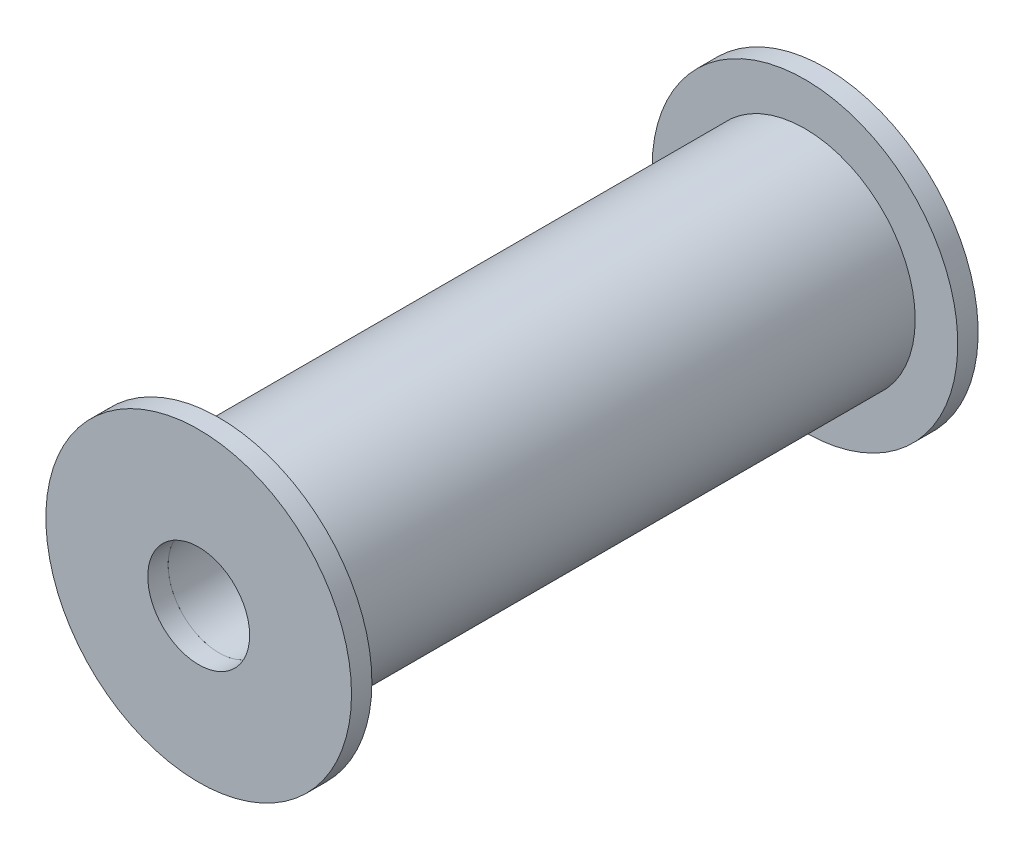
ISO-10303-21;
HEADER;
FILE_DESCRIPTION(('STEP AP214'),'2;1');
FILE_NAME('part.step','',(''),(''),'','','');
FILE_SCHEMA(('AUTOMOTIVE_DESIGN { 1 0 10303 214 1 1 1 1 }'));
ENDSEC;
DATA;
#1=APPLICATION_CONTEXT('core data for automotive mechanical design processes');
#2=APPLICATION_PROTOCOL_DEFINITION('international standard','automotive_design',2000,#1);
#3=PRODUCT_CONTEXT('',#1,'mechanical');
#4=PRODUCT('Part','Part','',(#3));
#5=PRODUCT_RELATED_PRODUCT_CATEGORY('part','',(#4));
#6=PRODUCT_DEFINITION_FORMATION('','',#4);
#7=PRODUCT_DEFINITION_CONTEXT('part definition',#1,'design');
#8=PRODUCT_DEFINITION('design','',#6,#7);
#9=PRODUCT_DEFINITION_SHAPE('','',#8);
#10=(LENGTH_UNIT() NAMED_UNIT(*) SI_UNIT(.MILLI.,.METRE.));
#11=(NAMED_UNIT(*) PLANE_ANGLE_UNIT() SI_UNIT($,.RADIAN.));
#12=(NAMED_UNIT(*) SI_UNIT($,.STERADIAN.) SOLID_ANGLE_UNIT());
#13=UNCERTAINTY_MEASURE_WITH_UNIT(LENGTH_MEASURE(1.E-05),#10,'distance_accuracy_value','');
#14=(GEOMETRIC_REPRESENTATION_CONTEXT(3) GLOBAL_UNCERTAINTY_ASSIGNED_CONTEXT((#13)) GLOBAL_UNIT_ASSIGNED_CONTEXT((#10,
#11,#12)) REPRESENTATION_CONTEXT('',''));
#15=CARTESIAN_POINT('',(0.,0.,0.));
#16=DIRECTION('',(0.,0.,1.));
#17=DIRECTION('',(1.,0.,0.));
#18=AXIS2_PLACEMENT_3D('',#15,#16,#17);
#19=CARTESIAN_POINT('',(0.,0.,119.));
#20=DIRECTION('',(0.,0.,1.));
#21=DIRECTION('',(1.,0.,0.));
#22=AXIS2_PLACEMENT_3D('',#19,#20,#21);
#23=PLANE('',#22);
#24=CARTESIAN_POINT('',(0.,0.,119.));
#25=DIRECTION('',(0.,0.,1.));
#26=DIRECTION('',(1.,0.,0.));
#27=AXIS2_PLACEMENT_3D('',#24,#25,#26);
#28=CIRCLE('',#27,30.);
#29=CARTESIAN_POINT('',(30.,0.,119.));
#30=VERTEX_POINT('',#29);
#31=EDGE_CURVE('E11',#30,#30,#28,.T.);
#32=ORIENTED_EDGE('',*,*,#31,.T.);
#33=EDGE_LOOP('',(#32));
#34=FACE_BOUND('',#33,.T.);
#35=CARTESIAN_POINT('',(0.,0.,119.));
#36=DIRECTION('',(0.,0.,1.));
#37=DIRECTION('',(1.,0.,0.));
#38=AXIS2_PLACEMENT_3D('',#35,#36,#37);
#39=CIRCLE('',#38,10.);
#40=CARTESIAN_POINT('',(10.,0.,119.));
#41=VERTEX_POINT('',#40);
#42=EDGE_CURVE('E56',#41,#41,#39,.T.);
#43=ORIENTED_EDGE('',*,*,#42,.F.);
#44=EDGE_LOOP('',(#43));
#45=FACE_BOUND('',#44,.T.);
#46=ADVANCED_FACE('F45',(#34,#45),#23,.T.);
#47=CARTESIAN_POINT('',(0.,0.,115.));
#48=DIRECTION('',(0.,0.,1.));
#49=DIRECTION('',(1.,0.,0.));
#50=AXIS2_PLACEMENT_3D('',#47,#48,#49);
#51=PLANE('',#50);
#52=CARTESIAN_POINT('',(0.,0.,115.));
#53=DIRECTION('',(0.,0.,1.));
#54=DIRECTION('',(1.,0.,0.));
#55=AXIS2_PLACEMENT_3D('',#52,#53,#54);
#56=CIRCLE('',#55,30.);
#57=CARTESIAN_POINT('',(30.,0.,115.));
#58=VERTEX_POINT('',#57);
#59=EDGE_CURVE('E49',#58,#58,#56,.T.);
#60=ORIENTED_EDGE('',*,*,#59,.F.);
#61=EDGE_LOOP('',(#60));
#62=FACE_BOUND('',#61,.T.);
#63=CARTESIAN_POINT('',(0.,0.,115.));
#64=DIRECTION('',(0.,0.,1.));
#65=DIRECTION('',(1.,0.,0.));
#66=AXIS2_PLACEMENT_3D('',#63,#64,#65);
#67=CIRCLE('',#66,10.);
#68=CARTESIAN_POINT('',(10.,0.,115.));
#69=VERTEX_POINT('',#68);
#70=EDGE_CURVE('E58',#69,#69,#67,.T.);
#71=ORIENTED_EDGE('',*,*,#70,.T.);
#72=EDGE_LOOP('',(#71));
#73=FACE_BOUND('',#72,.T.);
#74=ADVANCED_FACE('F68',(#62,#73),#51,.F.);
#75=CARTESIAN_POINT('',(0.,0.,119.));
#76=DIRECTION('',(0.,0.,-1.));
#77=DIRECTION('',(-1.,0.,0.));
#78=AXIS2_PLACEMENT_3D('',#75,#76,#77);
#79=CYLINDRICAL_SURFACE('',#78,30.);
#80=ORIENTED_EDGE('',*,*,#31,.F.);
#81=EDGE_LOOP('',(#80));
#82=FACE_BOUND('',#81,.T.);
#83=ORIENTED_EDGE('',*,*,#59,.T.);
#84=EDGE_LOOP('',(#83));
#85=FACE_BOUND('',#84,.T.);
#86=ADVANCED_FACE('F47',(#82,#85),#79,.T.);
#87=CARTESIAN_POINT('',(0.,0.,119.));
#88=DIRECTION('',(0.,0.,-1.));
#89=DIRECTION('',(-1.,0.,0.));
#90=AXIS2_PLACEMENT_3D('',#87,#88,#89);
#91=CYLINDRICAL_SURFACE('',#90,10.);
#92=ORIENTED_EDGE('',*,*,#42,.T.);
#93=EDGE_LOOP('',(#92));
#94=FACE_BOUND('',#93,.T.);
#95=ORIENTED_EDGE('',*,*,#70,.F.);
#96=EDGE_LOOP('',(#95));
#97=FACE_BOUND('',#96,.T.);
#98=ADVANCED_FACE('F64',(#94,#97),#91,.F.);
#99=CLOSED_SHELL('',(#46,#74,#86,#98));
#100=MANIFOLD_SOLID_BREP('B2',#99);
#101=CARTESIAN_POINT('',(0.,0.,115.));
#102=DIRECTION('',(0.,0.,1.));
#103=DIRECTION('',(1.,0.,0.));
#104=AXIS2_PLACEMENT_3D('',#101,#102,#103);
#105=PLANE('',#104);
#106=CARTESIAN_POINT('',(0.,0.,115.));
#107=DIRECTION('',(0.,0.,1.));
#108=DIRECTION('',(1.,0.,0.));
#109=AXIS2_PLACEMENT_3D('',#106,#107,#108);
#110=CIRCLE('',#109,21.643869335);
#111=CARTESIAN_POINT('',(21.643869335,0.,115.));
#112=VERTEX_POINT('',#111);
#113=EDGE_CURVE('E44',#112,#112,#110,.T.);
#114=ORIENTED_EDGE('',*,*,#113,.T.);
#115=EDGE_LOOP('',(#114));
#116=FACE_BOUND('',#115,.T.);
#117=CARTESIAN_POINT('',(0.,0.,115.));
#118=DIRECTION('',(0.,0.,1.));
#119=DIRECTION('',(1.,0.,0.));
#120=AXIS2_PLACEMENT_3D('',#117,#118,#119);
#121=CIRCLE('',#120,10.);
#122=CARTESIAN_POINT('',(10.,0.,115.));
#123=VERTEX_POINT('',#122);
#124=EDGE_CURVE('E115',#123,#123,#121,.T.);
#125=ORIENTED_EDGE('',*,*,#124,.F.);
#126=EDGE_LOOP('',(#125));
#127=FACE_BOUND('',#126,.T.);
#128=ADVANCED_FACE('F107',(#116,#127),#105,.T.);
#129=CARTESIAN_POINT('',(0.,0.,115.));
#130=DIRECTION('',(0.,0.,-1.));
#131=DIRECTION('',(-1.,0.,0.));
#132=AXIS2_PLACEMENT_3D('',#129,#130,#131);
#133=CYLINDRICAL_SURFACE('',#132,21.643869335);
#134=ORIENTED_EDGE('',*,*,#113,.F.);
#135=EDGE_LOOP('',(#134));
#136=FACE_BOUND('',#135,.T.);
#137=CARTESIAN_POINT('',(0.,0.,0.));
#138=DIRECTION('',(0.,0.,1.));
#139=DIRECTION('',(1.,0.,0.));
#140=AXIS2_PLACEMENT_3D('',#137,#138,#139);
#141=CIRCLE('',#140,21.643869335);
#142=CARTESIAN_POINT('',(21.643869335,0.,0.));
#143=VERTEX_POINT('',#142);
#144=EDGE_CURVE('E111',#143,#143,#141,.T.);
#145=ORIENTED_EDGE('',*,*,#144,.T.);
#146=EDGE_LOOP('',(#145));
#147=FACE_BOUND('',#146,.T.);
#148=ADVANCED_FACE('F109',(#136,#147),#133,.T.);
#149=CARTESIAN_POINT('',(0.,0.,115.));
#150=DIRECTION('',(0.,0.,-1.));
#151=DIRECTION('',(-1.,0.,0.));
#152=AXIS2_PLACEMENT_3D('',#149,#150,#151);
#153=CYLINDRICAL_SURFACE('',#152,10.);
#154=ORIENTED_EDGE('',*,*,#124,.T.);
#155=EDGE_LOOP('',(#154));
#156=FACE_BOUND('',#155,.T.);
#157=CARTESIAN_POINT('',(0.,0.,-4.));
#158=DIRECTION('',(0.,0.,-1.));
#159=DIRECTION('',(-1.,0.,0.));
#160=AXIS2_PLACEMENT_3D('',#157,#158,#159);
#161=CIRCLE('',#160,10.);
#162=CARTESIAN_POINT('',(-10.,0.,-4.));
#163=VERTEX_POINT('',#162);
#164=EDGE_CURVE('E125',#163,#163,#161,.T.);
#165=ORIENTED_EDGE('',*,*,#164,.T.);
#166=EDGE_LOOP('',(#165));
#167=FACE_BOUND('',#166,.T.);
#168=ADVANCED_FACE('F131',(#156,#167),#153,.F.);
#169=CARTESIAN_POINT('',(0.,0.,-4.));
#170=DIRECTION('',(0.,0.,-1.));
#171=DIRECTION('',(-1.,0.,0.));
#172=AXIS2_PLACEMENT_3D('',#169,#170,#171);
#173=PLANE('',#172);
#174=CARTESIAN_POINT('',(0.,0.,-4.));
#175=DIRECTION('',(0.,0.,-1.));
#176=DIRECTION('',(-1.,0.,0.));
#177=AXIS2_PLACEMENT_3D('',#174,#175,#176);
#178=CIRCLE('',#177,30.);
#179=CARTESIAN_POINT('',(-30.,0.,-4.));
#180=VERTEX_POINT('',#179);
#181=EDGE_CURVE('E124',#180,#180,#178,.T.);
#182=ORIENTED_EDGE('',*,*,#181,.T.);
#183=EDGE_LOOP('',(#182));
#184=FACE_BOUND('',#183,.T.);
#185=ORIENTED_EDGE('',*,*,#164,.F.);
#186=EDGE_LOOP('',(#185));
#187=FACE_BOUND('',#186,.T.);
#188=ADVANCED_FACE('F133',(#184,#187),#173,.T.);
#189=CARTESIAN_POINT('',(0.,0.,0.));
#190=DIRECTION('',(0.,0.,-1.));
#191=DIRECTION('',(-1.,0.,0.));
#192=AXIS2_PLACEMENT_3D('',#189,#190,#191);
#193=PLANE('',#192);
#194=ORIENTED_EDGE('',*,*,#144,.F.);
#195=EDGE_LOOP('',(#194));
#196=FACE_BOUND('',#195,.T.);
#197=CARTESIAN_POINT('',(0.,0.,0.));
#198=DIRECTION('',(0.,0.,-1.));
#199=DIRECTION('',(-1.,0.,0.));
#200=AXIS2_PLACEMENT_3D('',#197,#198,#199);
#201=CIRCLE('',#200,30.);
#202=CARTESIAN_POINT('',(-30.,0.,0.));
#203=VERTEX_POINT('',#202);
#204=EDGE_CURVE('E121',#203,#203,#201,.T.);
#205=ORIENTED_EDGE('',*,*,#204,.F.);
#206=EDGE_LOOP('',(#205));
#207=FACE_BOUND('',#206,.T.);
#208=ADVANCED_FACE('F135',(#196,#207),#193,.F.);
#209=CARTESIAN_POINT('',(0.,0.,-4.));
#210=DIRECTION('',(0.,0.,1.));
#211=DIRECTION('',(1.,0.,0.));
#212=AXIS2_PLACEMENT_3D('',#209,#210,#211);
#213=CYLINDRICAL_SURFACE('',#212,30.);
#214=ORIENTED_EDGE('',*,*,#181,.F.);
#215=EDGE_LOOP('',(#214));
#216=FACE_BOUND('',#215,.T.);
#217=ORIENTED_EDGE('',*,*,#204,.T.);
#218=EDGE_LOOP('',(#217));
#219=FACE_BOUND('',#218,.T.);
#220=ADVANCED_FACE('F142',(#216,#219),#213,.T.);
#221=CLOSED_SHELL('',(#128,#148,#168,#188,#208,#220));
#222=MANIFOLD_SOLID_BREP('B6',#221);
#223=ADVANCED_BREP_SHAPE_REPRESENTATION('',(#18,#100,#222),#14);
#224=SHAPE_DEFINITION_REPRESENTATION(#9,#223);
ENDSEC;
END-ISO-10303-21;
